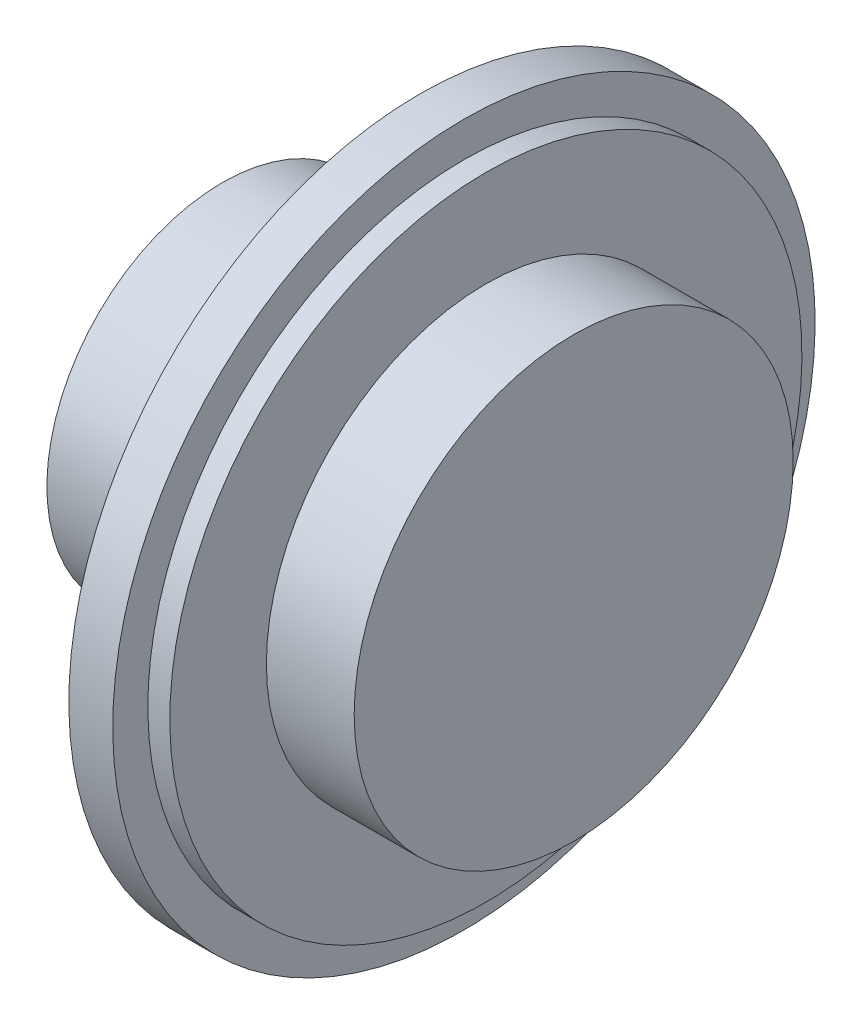
ISO-10303-21;
HEADER;
FILE_DESCRIPTION(('STEP AP214'),'2;1');
FILE_NAME('part.step','',(''),(''),'','','');
FILE_SCHEMA(('AUTOMOTIVE_DESIGN { 1 0 10303 214 1 1 1 1 }'));
ENDSEC;
DATA;
#1=APPLICATION_CONTEXT('core data for automotive mechanical design processes');
#2=APPLICATION_PROTOCOL_DEFINITION('international standard','automotive_design',2000,#1);
#3=PRODUCT_CONTEXT('',#1,'mechanical');
#4=PRODUCT('Part','Part','',(#3));
#5=PRODUCT_RELATED_PRODUCT_CATEGORY('part','',(#4));
#6=PRODUCT_DEFINITION_FORMATION('','',#4);
#7=PRODUCT_DEFINITION_CONTEXT('part definition',#1,'design');
#8=PRODUCT_DEFINITION('design','',#6,#7);
#9=PRODUCT_DEFINITION_SHAPE('','',#8);
#10=(LENGTH_UNIT() NAMED_UNIT(*) SI_UNIT(.MILLI.,.METRE.));
#11=(NAMED_UNIT(*) PLANE_ANGLE_UNIT() SI_UNIT($,.RADIAN.));
#12=(NAMED_UNIT(*) SI_UNIT($,.STERADIAN.) SOLID_ANGLE_UNIT());
#13=UNCERTAINTY_MEASURE_WITH_UNIT(LENGTH_MEASURE(1.E-05),#10,'distance_accuracy_value','');
#14=(GEOMETRIC_REPRESENTATION_CONTEXT(3) GLOBAL_UNCERTAINTY_ASSIGNED_CONTEXT((#13)) GLOBAL_UNIT_ASSIGNED_CONTEXT((#10,
#11,#12)) REPRESENTATION_CONTEXT('',''));
#15=CARTESIAN_POINT('',(0.,0.,0.));
#16=DIRECTION('',(0.,0.,1.));
#17=DIRECTION('',(1.,0.,0.));
#18=AXIS2_PLACEMENT_3D('',#15,#16,#17);
#19=CARTESIAN_POINT('',(0.,0.,0.));
#20=DIRECTION('',(-1.,0.,0.));
#21=DIRECTION('',(0.,-1.,0.));
#22=AXIS2_PLACEMENT_3D('',#19,#20,#21);
#23=PLANE('',#22);
#24=CARTESIAN_POINT('',(0.,0.,0.));
#25=DIRECTION('',(1.,0.,0.));
#26=DIRECTION('',(0.,1.,0.));
#27=AXIS2_PLACEMENT_3D('',#24,#25,#26);
#28=CIRCLE('',#27,10.);
#29=CARTESIAN_POINT('',(0.,10.,0.));
#30=VERTEX_POINT('',#29);
#31=EDGE_CURVE('E10',#30,#30,#28,.T.);
#32=ORIENTED_EDGE('',*,*,#31,.F.);
#33=EDGE_LOOP('',(#32));
#34=FACE_BOUND('',#33,.T.);
#35=ADVANCED_FACE('F31',(#34),#23,.T.);
#36=CARTESIAN_POINT('',(20.,0.,0.));
#37=DIRECTION('',(1.,0.,0.));
#38=DIRECTION('',(0.,1.,0.));
#39=AXIS2_PLACEMENT_3D('',#36,#37,#38);
#40=CYLINDRICAL_SURFACE('',#39,10.);
#41=ORIENTED_EDGE('',*,*,#31,.T.);
#42=EDGE_LOOP('',(#41));
#43=FACE_BOUND('',#42,.T.);
#44=CARTESIAN_POINT('',(10.,0.,0.));
#45=DIRECTION('',(1.,0.,0.));
#46=DIRECTION('',(0.,1.,0.));
#47=AXIS2_PLACEMENT_3D('',#44,#45,#46);
#48=CIRCLE('',#47,10.);
#49=CARTESIAN_POINT('',(10.,10.,0.));
#50=VERTEX_POINT('',#49);
#51=EDGE_CURVE('E37',#50,#50,#48,.T.);
#52=ORIENTED_EDGE('',*,*,#51,.F.);
#53=EDGE_LOOP('',(#52));
#54=FACE_BOUND('',#53,.T.);
#55=ADVANCED_FACE('F85',(#43,#54),#40,.T.);
#56=CARTESIAN_POINT('',(10.,10.,0.));
#57=DIRECTION('',(-1.,0.,0.));
#58=DIRECTION('',(0.,-1.,0.));
#59=AXIS2_PLACEMENT_3D('',#56,#57,#58);
#60=PLANE('',#59);
#61=ORIENTED_EDGE('',*,*,#51,.T.);
#62=EDGE_LOOP('',(#61));
#63=FACE_BOUND('',#62,.T.);
#64=CARTESIAN_POINT('',(10.,0.,0.));
#65=DIRECTION('',(1.,0.,0.));
#66=DIRECTION('',(0.,1.,0.));
#67=AXIS2_PLACEMENT_3D('',#64,#65,#66);
#68=CIRCLE('',#67,18.);
#69=CARTESIAN_POINT('',(10.,18.,0.));
#70=VERTEX_POINT('',#69);
#71=EDGE_CURVE('E41',#70,#70,#68,.T.);
#72=ORIENTED_EDGE('',*,*,#71,.F.);
#73=EDGE_LOOP('',(#72));
#74=FACE_BOUND('',#73,.T.);
#75=ADVANCED_FACE('F90',(#63,#74),#60,.T.);
#76=CARTESIAN_POINT('',(20.,0.,0.));
#77=DIRECTION('',(1.,0.,0.));
#78=DIRECTION('',(0.,1.,0.));
#79=AXIS2_PLACEMENT_3D('',#76,#77,#78);
#80=CYLINDRICAL_SURFACE('',#79,18.);
#81=ORIENTED_EDGE('',*,*,#71,.T.);
#82=EDGE_LOOP('',(#81));
#83=FACE_BOUND('',#82,.T.);
#84=CARTESIAN_POINT('',(11.25,0.,0.));
#85=DIRECTION('',(1.,0.,0.));
#86=DIRECTION('',(0.,1.,0.));
#87=AXIS2_PLACEMENT_3D('',#84,#85,#86);
#88=CIRCLE('',#87,18.);
#89=CARTESIAN_POINT('',(11.25,18.,0.));
#90=VERTEX_POINT('',#89);
#91=EDGE_CURVE('E45',#90,#90,#88,.T.);
#92=ORIENTED_EDGE('',*,*,#91,.F.);
#93=EDGE_LOOP('',(#92));
#94=FACE_BOUND('',#93,.T.);
#95=ADVANCED_FACE('F94',(#83,#94),#80,.T.);
#96=CARTESIAN_POINT('',(11.25,18.,0.));
#97=DIRECTION('',(-1.,0.,0.));
#98=DIRECTION('',(0.,-1.,0.));
#99=AXIS2_PLACEMENT_3D('',#96,#97,#98);
#100=PLANE('',#99);
#101=ORIENTED_EDGE('',*,*,#91,.T.);
#102=EDGE_LOOP('',(#101));
#103=FACE_BOUND('',#102,.T.);
#104=CARTESIAN_POINT('',(11.25,0.,0.));
#105=DIRECTION('',(1.,0.,0.));
#106=DIRECTION('',(0.,1.,0.));
#107=AXIS2_PLACEMENT_3D('',#104,#105,#106);
#108=CIRCLE('',#107,20.);
#109=CARTESIAN_POINT('',(11.25,20.,0.));
#110=VERTEX_POINT('',#109);
#111=EDGE_CURVE('E50',#110,#110,#108,.T.);
#112=ORIENTED_EDGE('',*,*,#111,.F.);
#113=EDGE_LOOP('',(#112));
#114=FACE_BOUND('',#113,.T.);
#115=ADVANCED_FACE('F100',(#103,#114),#100,.T.);
#116=CARTESIAN_POINT('',(20.,0.,0.));
#117=DIRECTION('',(1.,0.,0.));
#118=DIRECTION('',(0.,1.,0.));
#119=AXIS2_PLACEMENT_3D('',#116,#117,#118);
#120=CYLINDRICAL_SURFACE('',#119,20.);
#121=ORIENTED_EDGE('',*,*,#111,.T.);
#122=EDGE_LOOP('',(#121));
#123=FACE_BOUND('',#122,.T.);
#124=CARTESIAN_POINT('',(13.75,0.,0.));
#125=DIRECTION('',(1.,0.,0.));
#126=DIRECTION('',(0.,1.,0.));
#127=AXIS2_PLACEMENT_3D('',#124,#125,#126);
#128=CIRCLE('',#127,20.);
#129=CARTESIAN_POINT('',(13.75,20.,0.));
#130=VERTEX_POINT('',#129);
#131=EDGE_CURVE('E53',#130,#130,#128,.T.);
#132=ORIENTED_EDGE('',*,*,#131,.F.);
#133=EDGE_LOOP('',(#132));
#134=FACE_BOUND('',#133,.T.);
#135=ADVANCED_FACE('F104',(#123,#134),#120,.T.);
#136=CARTESIAN_POINT('',(13.75,20.,0.));
#137=DIRECTION('',(1.,0.,0.));
#138=DIRECTION('',(0.,1.,0.));
#139=AXIS2_PLACEMENT_3D('',#136,#137,#138);
#140=PLANE('',#139);
#141=ORIENTED_EDGE('',*,*,#131,.T.);
#142=EDGE_LOOP('',(#141));
#143=FACE_BOUND('',#142,.T.);
#144=CARTESIAN_POINT('',(13.75,0.,0.));
#145=DIRECTION('',(1.,0.,0.));
#146=DIRECTION('',(0.,1.,0.));
#147=AXIS2_PLACEMENT_3D('',#144,#145,#146);
#148=CIRCLE('',#147,18.);
#149=CARTESIAN_POINT('',(13.75,18.,0.));
#150=VERTEX_POINT('',#149);
#151=EDGE_CURVE('E56',#150,#150,#148,.T.);
#152=ORIENTED_EDGE('',*,*,#151,.F.);
#153=EDGE_LOOP('',(#152));
#154=FACE_BOUND('',#153,.T.);
#155=ADVANCED_FACE('F108',(#143,#154),#140,.T.);
#156=CARTESIAN_POINT('',(20.,0.,0.));
#157=DIRECTION('',(1.,0.,0.));
#158=DIRECTION('',(0.,1.,0.));
#159=AXIS2_PLACEMENT_3D('',#156,#157,#158);
#160=CYLINDRICAL_SURFACE('',#159,18.);
#161=ORIENTED_EDGE('',*,*,#151,.T.);
#162=EDGE_LOOP('',(#161));
#163=FACE_BOUND('',#162,.T.);
#164=CARTESIAN_POINT('',(15.,0.,0.));
#165=DIRECTION('',(1.,0.,0.));
#166=DIRECTION('',(0.,1.,0.));
#167=AXIS2_PLACEMENT_3D('',#164,#165,#166);
#168=CIRCLE('',#167,18.);
#169=CARTESIAN_POINT('',(15.,18.,0.));
#170=VERTEX_POINT('',#169);
#171=EDGE_CURVE('E59',#170,#170,#168,.T.);
#172=ORIENTED_EDGE('',*,*,#171,.F.);
#173=EDGE_LOOP('',(#172));
#174=FACE_BOUND('',#173,.T.);
#175=ADVANCED_FACE('F81',(#163,#174),#160,.T.);
#176=CARTESIAN_POINT('',(15.,18.,0.));
#177=DIRECTION('',(1.,0.,0.));
#178=DIRECTION('',(0.,1.,0.));
#179=AXIS2_PLACEMENT_3D('',#176,#177,#178);
#180=PLANE('',#179);
#181=ORIENTED_EDGE('',*,*,#171,.T.);
#182=EDGE_LOOP('',(#181));
#183=FACE_BOUND('',#182,.T.);
#184=CARTESIAN_POINT('',(15.,0.,0.));
#185=DIRECTION('',(1.,0.,0.));
#186=DIRECTION('',(0.,1.,0.));
#187=AXIS2_PLACEMENT_3D('',#184,#185,#186);
#188=CIRCLE('',#187,12.5);
#189=CARTESIAN_POINT('',(15.,12.5,0.));
#190=VERTEX_POINT('',#189);
#191=EDGE_CURVE('E62',#190,#190,#188,.T.);
#192=ORIENTED_EDGE('',*,*,#191,.F.);
#193=EDGE_LOOP('',(#192));
#194=FACE_BOUND('',#193,.T.);
#195=ADVANCED_FACE('F73',(#183,#194),#180,.T.);
#196=CARTESIAN_POINT('',(20.,0.,0.));
#197=DIRECTION('',(1.,0.,0.));
#198=DIRECTION('',(0.,1.,0.));
#199=AXIS2_PLACEMENT_3D('',#196,#197,#198);
#200=CYLINDRICAL_SURFACE('',#199,12.5);
#201=ORIENTED_EDGE('',*,*,#191,.T.);
#202=EDGE_LOOP('',(#201));
#203=FACE_BOUND('',#202,.T.);
#204=CARTESIAN_POINT('',(20.,0.,0.));
#205=DIRECTION('',(1.,0.,0.));
#206=DIRECTION('',(0.,1.,0.));
#207=AXIS2_PLACEMENT_3D('',#204,#205,#206);
#208=CIRCLE('',#207,12.5);
#209=CARTESIAN_POINT('',(20.,12.5,0.));
#210=VERTEX_POINT('',#209);
#211=EDGE_CURVE('E65',#210,#210,#208,.T.);
#212=ORIENTED_EDGE('',*,*,#211,.F.);
#213=EDGE_LOOP('',(#212));
#214=FACE_BOUND('',#213,.T.);
#215=ADVANCED_FACE('F71',(#203,#214),#200,.T.);
#216=CARTESIAN_POINT('',(20.,12.5,0.));
#217=DIRECTION('',(1.,0.,0.));
#218=DIRECTION('',(0.,1.,0.));
#219=AXIS2_PLACEMENT_3D('',#216,#217,#218);
#220=PLANE('',#219);
#221=ORIENTED_EDGE('',*,*,#211,.T.);
#222=EDGE_LOOP('',(#221));
#223=FACE_BOUND('',#222,.T.);
#224=ADVANCED_FACE('F69',(#223),#220,.T.);
#225=CLOSED_SHELL('',(#35,#55,#75,#95,#115,#135,#155,#175,#195,#215,#224));
#226=MANIFOLD_SOLID_BREP('B2',#225);
#227=ADVANCED_BREP_SHAPE_REPRESENTATION('',(#18,#226),#14);
#228=SHAPE_DEFINITION_REPRESENTATION(#9,#227);
ENDSEC;
END-ISO-10303-21;
